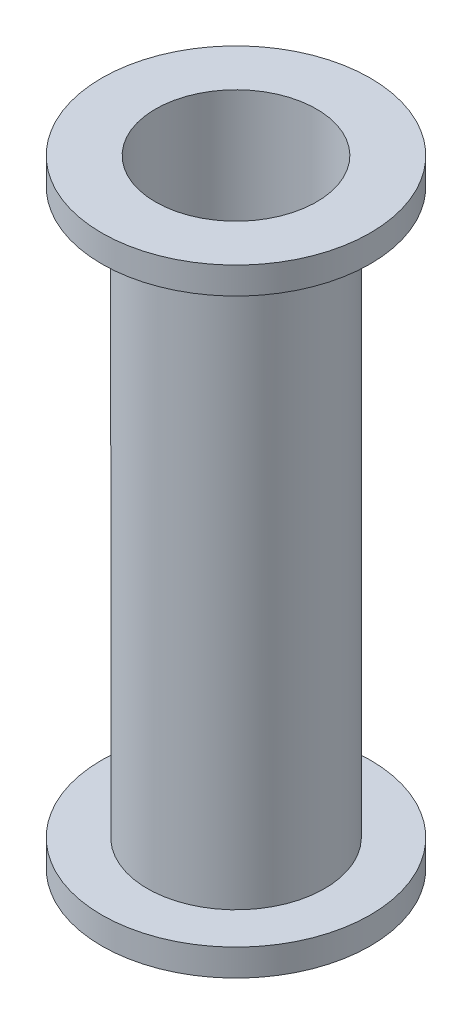
ISO-10303-21;
HEADER;
FILE_DESCRIPTION(('STEP AP214'),'2;1');
FILE_NAME('part.step','',(''),(''),'','','');
FILE_SCHEMA(('AUTOMOTIVE_DESIGN { 1 0 10303 214 1 1 1 1 }'));
ENDSEC;
DATA;
#1=APPLICATION_CONTEXT('core data for automotive mechanical design processes');
#2=APPLICATION_PROTOCOL_DEFINITION('international standard','automotive_design',2000,#1);
#3=PRODUCT_CONTEXT('',#1,'mechanical');
#4=PRODUCT('Part','Part','',(#3));
#5=PRODUCT_RELATED_PRODUCT_CATEGORY('part','',(#4));
#6=PRODUCT_DEFINITION_FORMATION('','',#4);
#7=PRODUCT_DEFINITION_CONTEXT('part definition',#1,'design');
#8=PRODUCT_DEFINITION('design','',#6,#7);
#9=PRODUCT_DEFINITION_SHAPE('','',#8);
#10=(LENGTH_UNIT() NAMED_UNIT(*) SI_UNIT(.MILLI.,.METRE.));
#11=(NAMED_UNIT(*) PLANE_ANGLE_UNIT() SI_UNIT($,.RADIAN.));
#12=(NAMED_UNIT(*) SI_UNIT($,.STERADIAN.) SOLID_ANGLE_UNIT());
#13=UNCERTAINTY_MEASURE_WITH_UNIT(LENGTH_MEASURE(1.E-05),#10,'distance_accuracy_value','');
#14=(GEOMETRIC_REPRESENTATION_CONTEXT(3) GLOBAL_UNCERTAINTY_ASSIGNED_CONTEXT((#13)) GLOBAL_UNIT_ASSIGNED_CONTEXT((#10,
#11,#12)) REPRESENTATION_CONTEXT('',''));
#15=CARTESIAN_POINT('',(0.,0.,0.));
#16=DIRECTION('',(0.,0.,1.));
#17=DIRECTION('',(1.,0.,0.));
#18=AXIS2_PLACEMENT_3D('',#15,#16,#17);
#19=CARTESIAN_POINT('',(0.,292.1,0.));
#20=DIRECTION('',(0.,-1.,0.));
#21=DIRECTION('',(0.,0.,-1.));
#22=AXIS2_PLACEMENT_3D('',#19,#20,#21);
#23=CYLINDRICAL_SURFACE('',#22,41.91);
#24=CARTESIAN_POINT('',(0.,12.7,0.));
#25=DIRECTION('',(0.,-1.,0.));
#26=DIRECTION('',(0.,0.,-1.));
#27=AXIS2_PLACEMENT_3D('',#24,#25,#26);
#28=CIRCLE('',#27,41.91);
#29=CARTESIAN_POINT('',(0.,12.7,-41.91));
#30=VERTEX_POINT('',#29);
#31=EDGE_CURVE('E44',#30,#30,#28,.T.);
#32=ORIENTED_EDGE('',*,*,#31,.F.);
#33=EDGE_LOOP('',(#32));
#34=FACE_BOUND('',#33,.T.);
#35=CARTESIAN_POINT('',(0.,279.4,0.));
#36=DIRECTION('',(0.,1.,0.));
#37=DIRECTION('',(0.,0.,1.));
#38=AXIS2_PLACEMENT_3D('',#35,#36,#37);
#39=CIRCLE('',#38,41.91);
#40=CARTESIAN_POINT('',(0.,279.4,41.91));
#41=VERTEX_POINT('',#40);
#42=EDGE_CURVE('E10',#41,#41,#39,.T.);
#43=ORIENTED_EDGE('',*,*,#42,.F.);
#44=EDGE_LOOP('',(#43));
#45=FACE_BOUND('',#44,.T.);
#46=ADVANCED_FACE('F37',(#34,#45),#23,.T.);
#47=CARTESIAN_POINT('',(0.,292.1,0.));
#48=DIRECTION('',(0.,1.,0.));
#49=DIRECTION('',(0.,0.,1.));
#50=AXIS2_PLACEMENT_3D('',#47,#48,#49);
#51=PLANE('',#50);
#52=CARTESIAN_POINT('',(0.,292.1,0.));
#53=DIRECTION('',(0.,1.,0.));
#54=DIRECTION('',(0.,0.,1.));
#55=AXIS2_PLACEMENT_3D('',#52,#53,#54);
#56=CIRCLE('',#55,38.1);
#57=CARTESIAN_POINT('',(0.,292.1,38.1));
#58=VERTEX_POINT('',#57);
#59=EDGE_CURVE('E49',#58,#58,#56,.T.);
#60=ORIENTED_EDGE('',*,*,#59,.F.);
#61=EDGE_LOOP('',(#60));
#62=FACE_BOUND('',#61,.T.);
#63=CARTESIAN_POINT('',(0.,292.1,0.));
#64=DIRECTION('',(0.,1.,0.));
#65=DIRECTION('',(0.,0.,1.));
#66=AXIS2_PLACEMENT_3D('',#63,#64,#65);
#67=CIRCLE('',#66,63.5);
#68=CARTESIAN_POINT('',(0.,292.1,63.5));
#69=VERTEX_POINT('',#68);
#70=EDGE_CURVE('E53',#69,#69,#67,.T.);
#71=ORIENTED_EDGE('',*,*,#70,.T.);
#72=EDGE_LOOP('',(#71));
#73=FACE_BOUND('',#72,.T.);
#74=ADVANCED_FACE('F81',(#62,#73),#51,.T.);
#75=CARTESIAN_POINT('',(0.,0.,0.));
#76=DIRECTION('',(0.,1.,0.));
#77=DIRECTION('',(0.,0.,1.));
#78=AXIS2_PLACEMENT_3D('',#75,#76,#77);
#79=PLANE('',#78);
#80=CARTESIAN_POINT('',(0.,0.,0.));
#81=DIRECTION('',(0.,1.,0.));
#82=DIRECTION('',(0.,0.,1.));
#83=AXIS2_PLACEMENT_3D('',#80,#81,#82);
#84=CIRCLE('',#83,38.1);
#85=CARTESIAN_POINT('',(0.,0.,38.1));
#86=VERTEX_POINT('',#85);
#87=EDGE_CURVE('E40',#86,#86,#84,.T.);
#88=ORIENTED_EDGE('',*,*,#87,.T.);
#89=EDGE_LOOP('',(#88));
#90=FACE_BOUND('',#89,.T.);
#91=CARTESIAN_POINT('',(0.,0.,0.));
#92=DIRECTION('',(0.,-1.,0.));
#93=DIRECTION('',(0.,0.,-1.));
#94=AXIS2_PLACEMENT_3D('',#91,#92,#93);
#95=CIRCLE('',#94,63.5);
#96=CARTESIAN_POINT('',(0.,0.,-63.5));
#97=VERTEX_POINT('',#96);
#98=EDGE_CURVE('E58',#97,#97,#95,.T.);
#99=ORIENTED_EDGE('',*,*,#98,.T.);
#100=EDGE_LOOP('',(#99));
#101=FACE_BOUND('',#100,.T.);
#102=ADVANCED_FACE('F67',(#90,#101),#79,.F.);
#103=CARTESIAN_POINT('',(0.,292.1,0.));
#104=DIRECTION('',(0.,-1.,0.));
#105=DIRECTION('',(0.,0.,-1.));
#106=AXIS2_PLACEMENT_3D('',#103,#104,#105);
#107=CYLINDRICAL_SURFACE('',#106,38.1);
#108=ORIENTED_EDGE('',*,*,#59,.T.);
#109=EDGE_LOOP('',(#108));
#110=FACE_BOUND('',#109,.T.);
#111=ORIENTED_EDGE('',*,*,#87,.F.);
#112=EDGE_LOOP('',(#111));
#113=FACE_BOUND('',#112,.T.);
#114=ADVANCED_FACE('F70',(#110,#113),#107,.F.);
#115=CARTESIAN_POINT('',(0.,12.7,0.));
#116=DIRECTION('',(0.,-1.,0.));
#117=DIRECTION('',(0.,0.,-1.));
#118=AXIS2_PLACEMENT_3D('',#115,#116,#117);
#119=PLANE('',#118);
#120=CARTESIAN_POINT('',(0.,12.7,0.));
#121=DIRECTION('',(0.,-1.,0.));
#122=DIRECTION('',(0.,0.,-1.));
#123=AXIS2_PLACEMENT_3D('',#120,#121,#122);
#124=CIRCLE('',#123,63.5);
#125=CARTESIAN_POINT('',(0.,12.7,-63.5));
#126=VERTEX_POINT('',#125);
#127=EDGE_CURVE('E55',#126,#126,#124,.T.);
#128=ORIENTED_EDGE('',*,*,#127,.F.);
#129=EDGE_LOOP('',(#128));
#130=FACE_BOUND('',#129,.T.);
#131=ORIENTED_EDGE('',*,*,#31,.T.);
#132=EDGE_LOOP('',(#131));
#133=FACE_BOUND('',#132,.T.);
#134=ADVANCED_FACE('F72',(#130,#133),#119,.F.);
#135=CARTESIAN_POINT('',(0.,12.7,0.));
#136=DIRECTION('',(0.,-1.,0.));
#137=DIRECTION('',(0.,0.,-1.));
#138=AXIS2_PLACEMENT_3D('',#135,#136,#137);
#139=CYLINDRICAL_SURFACE('',#138,63.5);
#140=ORIENTED_EDGE('',*,*,#127,.T.);
#141=EDGE_LOOP('',(#140));
#142=FACE_BOUND('',#141,.T.);
#143=ORIENTED_EDGE('',*,*,#98,.F.);
#144=EDGE_LOOP('',(#143));
#145=FACE_BOUND('',#144,.T.);
#146=ADVANCED_FACE('F78',(#142,#145),#139,.T.);
#147=CARTESIAN_POINT('',(0.,279.4,0.));
#148=DIRECTION('',(0.,1.,0.));
#149=DIRECTION('',(0.,0.,1.));
#150=AXIS2_PLACEMENT_3D('',#147,#148,#149);
#151=PLANE('',#150);
#152=CARTESIAN_POINT('',(0.,279.4,0.));
#153=DIRECTION('',(0.,1.,0.));
#154=DIRECTION('',(0.,0.,1.));
#155=AXIS2_PLACEMENT_3D('',#152,#153,#154);
#156=CIRCLE('',#155,63.5);
#157=CARTESIAN_POINT('',(0.,279.4,63.5));
#158=VERTEX_POINT('',#157);
#159=EDGE_CURVE('E60',#158,#158,#156,.T.);
#160=ORIENTED_EDGE('',*,*,#159,.F.);
#161=EDGE_LOOP('',(#160));
#162=FACE_BOUND('',#161,.T.);
#163=ORIENTED_EDGE('',*,*,#42,.T.);
#164=EDGE_LOOP('',(#163));
#165=FACE_BOUND('',#164,.T.);
#166=ADVANCED_FACE('F104',(#162,#165),#151,.F.);
#167=CARTESIAN_POINT('',(0.,279.4,0.));
#168=DIRECTION('',(0.,1.,0.));
#169=DIRECTION('',(0.,0.,1.));
#170=AXIS2_PLACEMENT_3D('',#167,#168,#169);
#171=CYLINDRICAL_SURFACE('',#170,63.5);
#172=ORIENTED_EDGE('',*,*,#159,.T.);
#173=EDGE_LOOP('',(#172));
#174=FACE_BOUND('',#173,.T.);
#175=ORIENTED_EDGE('',*,*,#70,.F.);
#176=EDGE_LOOP('',(#175));
#177=FACE_BOUND('',#176,.T.);
#178=ADVANCED_FACE('F102',(#174,#177),#171,.T.);
#179=CLOSED_SHELL('',(#46,#74,#102,#114,#134,#146,#166,#178));
#180=MANIFOLD_SOLID_BREP('B2',#179);
#181=ADVANCED_BREP_SHAPE_REPRESENTATION('',(#18,#180),#14);
#182=SHAPE_DEFINITION_REPRESENTATION(#9,#181);
ENDSEC;
END-ISO-10303-21;
